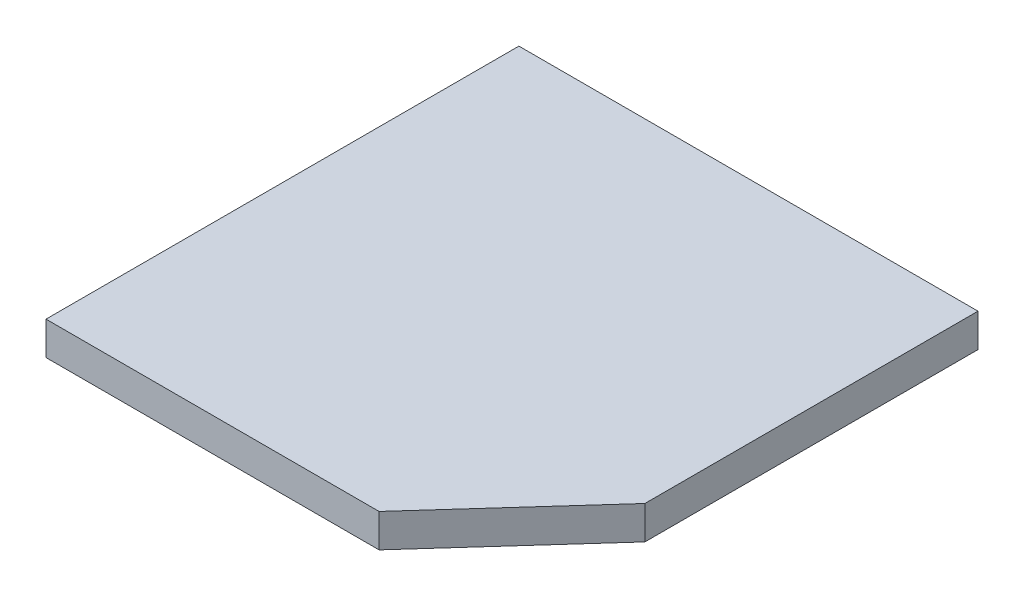
ISO-10303-21;
HEADER;
FILE_DESCRIPTION(('STEP AP214'),'2;1');
FILE_NAME('part.step','',(''),(''),'','','');
FILE_SCHEMA(('AUTOMOTIVE_DESIGN { 1 0 10303 214 1 1 1 1 }'));
ENDSEC;
DATA;
#1=APPLICATION_CONTEXT('core data for automotive mechanical design processes');
#2=APPLICATION_PROTOCOL_DEFINITION('international standard','automotive_design',2000,#1);
#3=PRODUCT_CONTEXT('',#1,'mechanical');
#4=PRODUCT('Part','Part','',(#3));
#5=PRODUCT_RELATED_PRODUCT_CATEGORY('part','',(#4));
#6=PRODUCT_DEFINITION_FORMATION('','',#4);
#7=PRODUCT_DEFINITION_CONTEXT('part definition',#1,'design');
#8=PRODUCT_DEFINITION('design','',#6,#7);
#9=PRODUCT_DEFINITION_SHAPE('','',#8);
#10=(LENGTH_UNIT() NAMED_UNIT(*) SI_UNIT(.MILLI.,.METRE.));
#11=(NAMED_UNIT(*) PLANE_ANGLE_UNIT() SI_UNIT($,.RADIAN.));
#12=(NAMED_UNIT(*) SI_UNIT($,.STERADIAN.) SOLID_ANGLE_UNIT());
#13=UNCERTAINTY_MEASURE_WITH_UNIT(LENGTH_MEASURE(1.E-05),#10,'distance_accuracy_value','');
#14=(GEOMETRIC_REPRESENTATION_CONTEXT(3) GLOBAL_UNCERTAINTY_ASSIGNED_CONTEXT((#13)) GLOBAL_UNIT_ASSIGNED_CONTEXT((#10,
#11,#12)) REPRESENTATION_CONTEXT('',''));
#15=CARTESIAN_POINT('',(0.,0.,0.));
#16=DIRECTION('',(0.,0.,1.));
#17=DIRECTION('',(1.,0.,0.));
#18=AXIS2_PLACEMENT_3D('',#15,#16,#17);
#19=CARTESIAN_POINT('',(0.,5.,0.));
#20=DIRECTION('',(1.,0.,0.));
#21=DIRECTION('',(0.,0.,1.));
#22=AXIS2_PLACEMENT_3D('',#19,#20,#21);
#23=PLANE('',#22);
#24=DIRECTION('',(0.,0.,-1.));
#25=VECTOR('',#24,1.);
#26=CARTESIAN_POINT('',(0.,0.,0.));
#27=LINE('',#26,#25);
#28=CARTESIAN_POINT('',(0.,0.,70.9876663776316));
#29=VERTEX_POINT('',#28);
#30=CARTESIAN_POINT('',(0.,0.,0.));
#31=VERTEX_POINT('',#30);
#32=EDGE_CURVE('E112',#29,#31,#27,.T.);
#33=ORIENTED_EDGE('',*,*,#32,.F.);
#34=DIRECTION('',(0.,-1.,0.));
#35=VECTOR('',#34,1.);
#36=CARTESIAN_POINT('',(0.,5.,70.9876663776316));
#37=LINE('',#36,#35);
#38=CARTESIAN_POINT('',(0.,5.,70.9876663776316));
#39=VERTEX_POINT('',#38);
#40=EDGE_CURVE('E111',#39,#29,#37,.T.);
#41=ORIENTED_EDGE('',*,*,#40,.F.);
#42=DIRECTION('',(0.,0.,-1.));
#43=VECTOR('',#42,1.);
#44=CARTESIAN_POINT('',(0.,5.,0.));
#45=LINE('',#44,#43);
#46=CARTESIAN_POINT('',(0.,5.,0.));
#47=VERTEX_POINT('',#46);
#48=EDGE_CURVE('E106',#39,#47,#45,.T.);
#49=ORIENTED_EDGE('',*,*,#48,.T.);
#50=DIRECTION('',(0.,-1.,0.));
#51=VECTOR('',#50,1.);
#52=CARTESIAN_POINT('',(0.,5.,0.));
#53=LINE('',#52,#51);
#54=EDGE_CURVE('E11',#47,#31,#53,.T.);
#55=ORIENTED_EDGE('',*,*,#54,.T.);
#56=EDGE_LOOP('',(#33,#41,#49,#55));
#57=FACE_BOUND('',#56,.T.);
#58=ADVANCED_FACE('F37',(#57),#23,.F.);
#59=CARTESIAN_POINT('',(0.,5.,0.));
#60=DIRECTION('',(0.,0.,1.));
#61=DIRECTION('',(-1.,0.,0.));
#62=AXIS2_PLACEMENT_3D('',#59,#60,#61);
#63=PLANE('',#62);
#64=DIRECTION('',(1.,0.,0.));
#65=VECTOR('',#64,1.);
#66=CARTESIAN_POINT('',(0.,0.,0.));
#67=LINE('',#66,#65);
#68=CARTESIAN_POINT('',(68.9141987134367,0.,0.));
#69=VERTEX_POINT('',#68);
#70=EDGE_CURVE('E114',#31,#69,#67,.T.);
#71=ORIENTED_EDGE('',*,*,#70,.F.);
#72=ORIENTED_EDGE('',*,*,#54,.F.);
#73=DIRECTION('',(1.,0.,0.));
#74=VECTOR('',#73,1.);
#75=CARTESIAN_POINT('',(0.,5.,0.));
#76=LINE('',#75,#74);
#77=CARTESIAN_POINT('',(68.9141987134367,5.,0.));
#78=VERTEX_POINT('',#77);
#79=EDGE_CURVE('E82',#47,#78,#76,.T.);
#80=ORIENTED_EDGE('',*,*,#79,.T.);
#81=DIRECTION('',(0.,-1.,0.));
#82=VECTOR('',#81,1.);
#83=CARTESIAN_POINT('',(68.9141987134367,5.,0.));
#84=LINE('',#83,#82);
#85=EDGE_CURVE('E45',#78,#69,#84,.T.);
#86=ORIENTED_EDGE('',*,*,#85,.T.);
#87=EDGE_LOOP('',(#71,#72,#80,#86));
#88=FACE_BOUND('',#87,.T.);
#89=ADVANCED_FACE('F123',(#88),#63,.F.);
#90=CARTESIAN_POINT('',(68.9141987134367,5.,0.));
#91=DIRECTION('',(-1.,0.,0.));
#92=DIRECTION('',(0.,0.,-1.));
#93=AXIS2_PLACEMENT_3D('',#90,#91,#92);
#94=PLANE('',#93);
#95=DIRECTION('',(0.,0.,1.));
#96=VECTOR('',#95,1.);
#97=CARTESIAN_POINT('',(68.9141987134367,0.,0.));
#98=LINE('',#97,#96);
#99=CARTESIAN_POINT('',(68.9141987134367,0.,50.));
#100=VERTEX_POINT('',#99);
#101=EDGE_CURVE('E117',#69,#100,#98,.T.);
#102=ORIENTED_EDGE('',*,*,#101,.F.);
#103=ORIENTED_EDGE('',*,*,#85,.F.);
#104=DIRECTION('',(0.,0.,1.));
#105=VECTOR('',#104,1.);
#106=CARTESIAN_POINT('',(68.9141987134367,5.,0.));
#107=LINE('',#106,#105);
#108=CARTESIAN_POINT('',(68.9141987134367,5.,50.));
#109=VERTEX_POINT('',#108);
#110=EDGE_CURVE('E91',#78,#109,#107,.T.);
#111=ORIENTED_EDGE('',*,*,#110,.T.);
#112=DIRECTION('',(0.,-1.,0.));
#113=VECTOR('',#112,1.);
#114=CARTESIAN_POINT('',(68.9141987134367,5.,50.));
#115=LINE('',#114,#113);
#116=EDGE_CURVE('E96',#109,#100,#115,.T.);
#117=ORIENTED_EDGE('',*,*,#116,.T.);
#118=EDGE_LOOP('',(#102,#103,#111,#117));
#119=FACE_BOUND('',#118,.T.);
#120=ADVANCED_FACE('F103',(#119),#94,.F.);
#121=CARTESIAN_POINT('',(50.,5.,70.9876663776316));
#122=DIRECTION('',(-0.742848732488238,0.,-0.669459304693436));
#123=DIRECTION('',(0.669459304693436,0.,-0.742848732488238));
#124=AXIS2_PLACEMENT_3D('',#121,#122,#123);
#125=PLANE('',#124);
#126=DIRECTION('',(-0.669459304693436,0.,0.742848732488238));
#127=VECTOR('',#126,1.);
#128=CARTESIAN_POINT('',(50.,0.,70.9876663776316));
#129=LINE('',#128,#127);
#130=CARTESIAN_POINT('',(50.,0.,70.9876663776316));
#131=VERTEX_POINT('',#130);
#132=EDGE_CURVE('E98',#100,#131,#129,.T.);
#133=ORIENTED_EDGE('',*,*,#132,.F.);
#134=ORIENTED_EDGE('',*,*,#116,.F.);
#135=DIRECTION('',(-0.669459304693436,0.,0.742848732488238));
#136=VECTOR('',#135,1.);
#137=CARTESIAN_POINT('',(50.,5.,70.9876663776316));
#138=LINE('',#137,#136);
#139=CARTESIAN_POINT('',(50.,5.,70.9876663776316));
#140=VERTEX_POINT('',#139);
#141=EDGE_CURVE('E87',#109,#140,#138,.T.);
#142=ORIENTED_EDGE('',*,*,#141,.T.);
#143=DIRECTION('',(0.,-1.,0.));
#144=VECTOR('',#143,1.);
#145=CARTESIAN_POINT('',(50.,5.,70.9876663776316));
#146=LINE('',#145,#144);
#147=EDGE_CURVE('E101',#140,#131,#146,.T.);
#148=ORIENTED_EDGE('',*,*,#147,.T.);
#149=EDGE_LOOP('',(#133,#134,#142,#148));
#150=FACE_BOUND('',#149,.T.);
#151=ADVANCED_FACE('F97',(#150),#125,.F.);
#152=CARTESIAN_POINT('',(0.,5.,70.9876663776316));
#153=DIRECTION('',(0.,0.,-1.));
#154=DIRECTION('',(1.,0.,0.));
#155=AXIS2_PLACEMENT_3D('',#152,#153,#154);
#156=PLANE('',#155);
#157=DIRECTION('',(-1.,0.,0.));
#158=VECTOR('',#157,1.);
#159=CARTESIAN_POINT('',(0.,0.,70.9876663776316));
#160=LINE('',#159,#158);
#161=EDGE_CURVE('E70',#131,#29,#160,.T.);
#162=ORIENTED_EDGE('',*,*,#161,.F.);
#163=ORIENTED_EDGE('',*,*,#147,.F.);
#164=DIRECTION('',(-1.,0.,0.));
#165=VECTOR('',#164,1.);
#166=CARTESIAN_POINT('',(0.,5.,70.9876663776316));
#167=LINE('',#166,#165);
#168=EDGE_CURVE('E53',#140,#39,#167,.T.);
#169=ORIENTED_EDGE('',*,*,#168,.T.);
#170=ORIENTED_EDGE('',*,*,#40,.T.);
#171=EDGE_LOOP('',(#162,#163,#169,#170));
#172=FACE_BOUND('',#171,.T.);
#173=ADVANCED_FACE('F129',(#172),#156,.F.);
#174=CARTESIAN_POINT('',(0.,5.,0.));
#175=DIRECTION('',(0.,-1.,0.));
#176=DIRECTION('',(0.,0.,1.));
#177=AXIS2_PLACEMENT_3D('',#174,#175,#176);
#178=PLANE('',#177);
#179=ORIENTED_EDGE('',*,*,#48,.F.);
#180=ORIENTED_EDGE('',*,*,#168,.F.);
#181=ORIENTED_EDGE('',*,*,#141,.F.);
#182=ORIENTED_EDGE('',*,*,#110,.F.);
#183=ORIENTED_EDGE('',*,*,#79,.F.);
#184=EDGE_LOOP('',(#179,#180,#181,#182,#183));
#185=FACE_BOUND('',#184,.T.);
#186=ADVANCED_FACE('F89',(#185),#178,.F.);
#187=CARTESIAN_POINT('',(0.,0.,0.));
#188=DIRECTION('',(0.,-1.,0.));
#189=DIRECTION('',(0.,0.,1.));
#190=AXIS2_PLACEMENT_3D('',#187,#188,#189);
#191=PLANE('',#190);
#192=ORIENTED_EDGE('',*,*,#32,.T.);
#193=ORIENTED_EDGE('',*,*,#70,.T.);
#194=ORIENTED_EDGE('',*,*,#101,.T.);
#195=ORIENTED_EDGE('',*,*,#132,.T.);
#196=ORIENTED_EDGE('',*,*,#161,.T.);
#197=EDGE_LOOP('',(#192,#193,#194,#195,#196));
#198=FACE_BOUND('',#197,.T.);
#199=ADVANCED_FACE('F124',(#198),#191,.T.);
#200=CLOSED_SHELL('',(#58,#89,#120,#151,#173,#186,#199));
#201=MANIFOLD_SOLID_BREP('B2',#200);
#202=ADVANCED_BREP_SHAPE_REPRESENTATION('',(#18,#201),#14);
#203=SHAPE_DEFINITION_REPRESENTATION(#9,#202);
ENDSEC;
END-ISO-10303-21;
